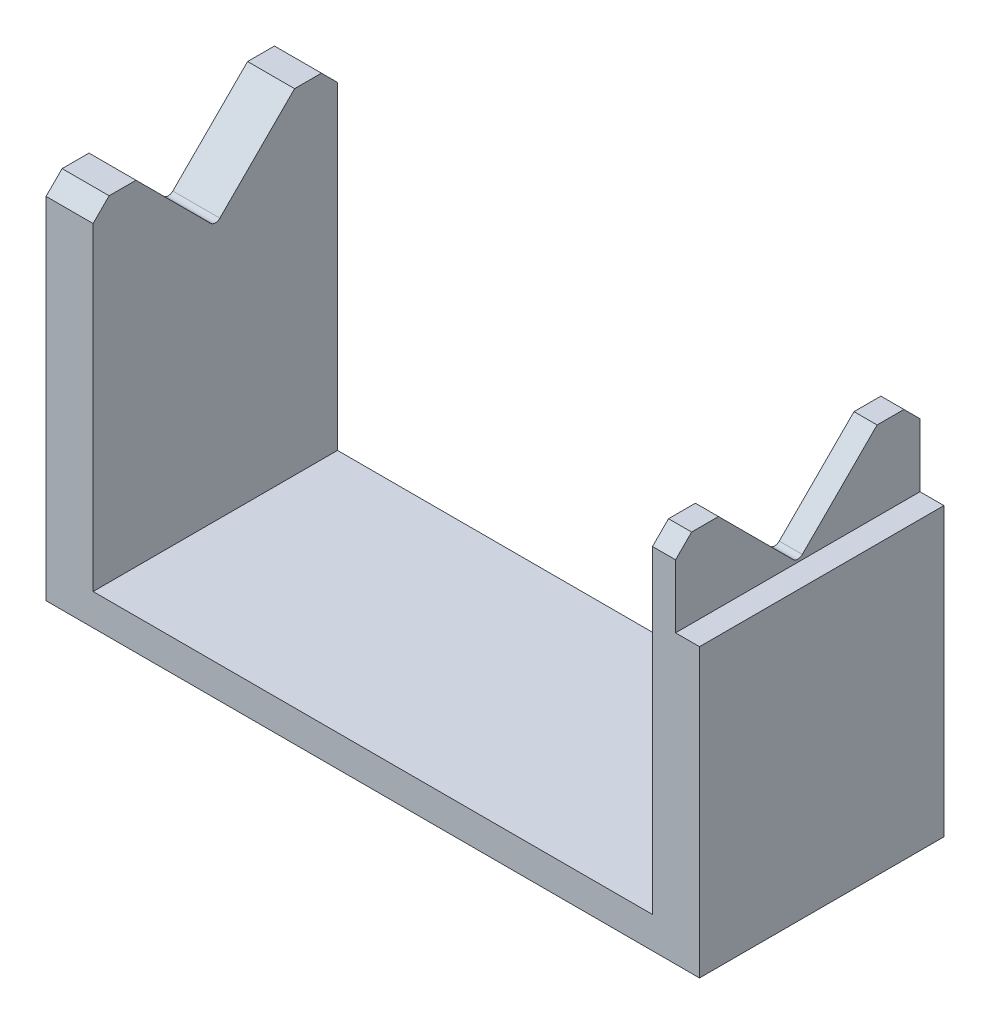
ISO-10303-21;
HEADER;
FILE_DESCRIPTION(('STEP AP214'),'2;1');
FILE_NAME('part.step','',(''),(''),'','','');
FILE_SCHEMA(('AUTOMOTIVE_DESIGN { 1 0 10303 214 1 1 1 1 }'));
ENDSEC;
DATA;
#1=APPLICATION_CONTEXT('core data for automotive mechanical design processes');
#2=APPLICATION_PROTOCOL_DEFINITION('international standard','automotive_design',2000,#1);
#3=PRODUCT_CONTEXT('',#1,'mechanical');
#4=PRODUCT('Part','Part','',(#3));
#5=PRODUCT_RELATED_PRODUCT_CATEGORY('part','',(#4));
#6=PRODUCT_DEFINITION_FORMATION('','',#4);
#7=PRODUCT_DEFINITION_CONTEXT('part definition',#1,'design');
#8=PRODUCT_DEFINITION('design','',#6,#7);
#9=PRODUCT_DEFINITION_SHAPE('','',#8);
#10=(LENGTH_UNIT() NAMED_UNIT(*) SI_UNIT(.MILLI.,.METRE.));
#11=(NAMED_UNIT(*) PLANE_ANGLE_UNIT() SI_UNIT($,.RADIAN.));
#12=(NAMED_UNIT(*) SI_UNIT($,.STERADIAN.) SOLID_ANGLE_UNIT());
#13=UNCERTAINTY_MEASURE_WITH_UNIT(LENGTH_MEASURE(1.E-05),#10,'distance_accuracy_value','');
#14=(GEOMETRIC_REPRESENTATION_CONTEXT(3) GLOBAL_UNCERTAINTY_ASSIGNED_CONTEXT((#13)) GLOBAL_UNIT_ASSIGNED_CONTEXT((#10,
#11,#12)) REPRESENTATION_CONTEXT('',''));
#15=CARTESIAN_POINT('',(0.,0.,0.));
#16=DIRECTION('',(0.,0.,1.));
#17=DIRECTION('',(1.,0.,0.));
#18=AXIS2_PLACEMENT_3D('',#15,#16,#17);
#19=CARTESIAN_POINT('',(0.,57.09,0.));
#20=DIRECTION('',(0.,1.,0.));
#21=DIRECTION('',(0.,0.,1.));
#22=AXIS2_PLACEMENT_3D('',#19,#20,#21);
#23=PLANE('',#22);
#24=DIRECTION('',(0.,0.,1.));
#25=VECTOR('',#24,1.);
#26=CARTESIAN_POINT('',(-43.6,57.09,0.));
#27=LINE('',#26,#25);
#28=CARTESIAN_POINT('',(-43.6,57.09,-16.55));
#29=VERTEX_POINT('',#28);
#30=CARTESIAN_POINT('',(-43.6,57.09,-12.36));
#31=VERTEX_POINT('',#30);
#32=EDGE_CURVE('E294',#29,#31,#27,.T.);
#33=ORIENTED_EDGE('',*,*,#32,.F.);
#34=DIRECTION('',(-1.,0.,0.));
#35=VECTOR('',#34,1.);
#36=CARTESIAN_POINT('',(-50.93,57.09,-16.55));
#37=LINE('',#36,#35);
#38=CARTESIAN_POINT('',(-50.93,57.09,-16.55));
#39=VERTEX_POINT('',#38);
#40=EDGE_CURVE('E332',#29,#39,#37,.T.);
#41=ORIENTED_EDGE('',*,*,#40,.T.);
#42=DIRECTION('',(0.,0.,1.));
#43=VECTOR('',#42,1.);
#44=CARTESIAN_POINT('',(-50.93,57.09,19.05));
#45=LINE('',#44,#43);
#46=CARTESIAN_POINT('',(-50.93,57.09,-12.36));
#47=VERTEX_POINT('',#46);
#48=EDGE_CURVE('E269',#39,#47,#45,.T.);
#49=ORIENTED_EDGE('',*,*,#48,.T.);
#50=DIRECTION('',(1.,0.,0.));
#51=VECTOR('',#50,1.);
#52=CARTESIAN_POINT('',(-952.8,57.09,-12.36));
#53=LINE('',#52,#51);
#54=EDGE_CURVE('E214',#47,#31,#53,.T.);
#55=ORIENTED_EDGE('',*,*,#54,.T.);
#56=EDGE_LOOP('',(#33,#41,#49,#55));
#57=FACE_BOUND('',#56,.T.);
#58=ADVANCED_FACE('F33',(#57),#23,.T.);
#59=DIRECTION('',(0.,0.,1.));
#60=VECTOR('',#59,1.);
#61=CARTESIAN_POINT('',(47.2,57.09,0.));
#62=LINE('',#61,#60);
#63=CARTESIAN_POINT('',(47.2,57.09,-16.55));
#64=VERTEX_POINT('',#63);
#65=CARTESIAN_POINT('',(47.2,57.09,-12.36));
#66=VERTEX_POINT('',#65);
#67=EDGE_CURVE('E186',#64,#66,#62,.T.);
#68=ORIENTED_EDGE('',*,*,#67,.F.);
#69=DIRECTION('',(-1.,0.,0.));
#70=VECTOR('',#69,1.);
#71=CARTESIAN_POINT('',(43.6,57.09,-16.55));
#72=LINE('',#71,#70);
#73=CARTESIAN_POINT('',(43.6,57.09,-16.55));
#74=VERTEX_POINT('',#73);
#75=EDGE_CURVE('E339',#64,#74,#72,.T.);
#76=ORIENTED_EDGE('',*,*,#75,.T.);
#77=DIRECTION('',(0.,0.,-1.));
#78=VECTOR('',#77,1.);
#79=CARTESIAN_POINT('',(43.6,57.09,0.));
#80=LINE('',#79,#78);
#81=CARTESIAN_POINT('',(43.6,57.09,-12.36));
#82=VERTEX_POINT('',#81);
#83=EDGE_CURVE('E213',#82,#74,#80,.T.);
#84=ORIENTED_EDGE('',*,*,#83,.F.);
#85=EDGE_CURVE('E205',#82,#66,#53,.T.);
#86=ORIENTED_EDGE('',*,*,#85,.T.);
#87=EDGE_LOOP('',(#68,#76,#84,#86));
#88=FACE_BOUND('',#87,.T.);
#89=ADVANCED_FACE('F211',(#88),#23,.T.);
#90=CARTESIAN_POINT('',(47.2,44.73,-38.04));
#91=DIRECTION('',(-1.,0.,0.));
#92=DIRECTION('',(0.,0.,1.));
#93=AXIS2_PLACEMENT_3D('',#90,#91,#92);
#94=PLANE('',#93);
#95=DIRECTION('',(0.,-1.,0.));
#96=VECTOR('',#95,1.);
#97=CARTESIAN_POINT('',(47.2,57.09,-19.05));
#98=LINE('',#97,#96);
#99=CARTESIAN_POINT('',(47.2,54.59,-19.05));
#100=VERTEX_POINT('',#99);
#101=CARTESIAN_POINT('',(47.2,44.73,-19.05));
#102=VERTEX_POINT('',#101);
#103=EDGE_CURVE('E246',#100,#102,#98,.T.);
#104=ORIENTED_EDGE('',*,*,#103,.F.);
#105=DIRECTION('',(0.,0.707106781186551,0.707106781186544));
#106=VECTOR('',#105,1.);
#107=CARTESIAN_POINT('',(47.2,57.09,-16.55));
#108=LINE('',#107,#106);
#109=EDGE_CURVE('E41',#100,#64,#108,.T.);
#110=ORIENTED_EDGE('',*,*,#109,.T.);
#111=ORIENTED_EDGE('',*,*,#67,.T.);
#112=DIRECTION('',(0.,0.707106781186549,-0.707106781186546));
#113=VECTOR('',#112,1.);
#114=CARTESIAN_POINT('',(47.2,44.73,0.));
#115=LINE('',#114,#113);
#116=CARTESIAN_POINT('',(47.2,45.4371067811865,-0.707106781186543));
#117=VERTEX_POINT('',#116);
#118=EDGE_CURVE('E191',#117,#66,#115,.T.);
#119=ORIENTED_EDGE('',*,*,#118,.F.);
#120=CARTESIAN_POINT('',(47.2,46.1442135623731,0.));
#121=DIRECTION('',(-1.,0.,0.));
#122=DIRECTION('',(0.,0.,1.));
#123=AXIS2_PLACEMENT_3D('',#120,#121,#122);
#124=CIRCLE('',#123,1.);
#125=CARTESIAN_POINT('',(47.2,45.4371067811865,0.707106781186546));
#126=VERTEX_POINT('',#125);
#127=EDGE_CURVE('E313',#117,#126,#124,.T.);
#128=ORIENTED_EDGE('',*,*,#127,.T.);
#129=DIRECTION('',(0.,-0.707106781186544,-0.707106781186551));
#130=VECTOR('',#129,1.);
#131=CARTESIAN_POINT('',(47.2,44.73,0.));
#132=LINE('',#131,#130);
#133=CARTESIAN_POINT('',(47.2,57.09,12.3600000000001));
#134=VERTEX_POINT('',#133);
#135=EDGE_CURVE('E209',#134,#126,#132,.T.);
#136=ORIENTED_EDGE('',*,*,#135,.F.);
#137=CARTESIAN_POINT('',(47.2,57.09,16.55));
#138=VERTEX_POINT('',#137);
#139=EDGE_CURVE('E198',#134,#138,#62,.T.);
#140=ORIENTED_EDGE('',*,*,#139,.T.);
#141=DIRECTION('',(0.,-0.707106781186552,0.707106781186543));
#142=VECTOR('',#141,1.);
#143=CARTESIAN_POINT('',(47.2,57.09,16.55));
#144=LINE('',#143,#142);
#145=CARTESIAN_POINT('',(47.2,54.59,19.05));
#146=VERTEX_POINT('',#145);
#147=EDGE_CURVE('E48',#138,#146,#144,.T.);
#148=ORIENTED_EDGE('',*,*,#147,.T.);
#149=DIRECTION('',(0.,-1.,0.));
#150=VECTOR('',#149,1.);
#151=CARTESIAN_POINT('',(47.2,44.73,19.05));
#152=LINE('',#151,#150);
#153=CARTESIAN_POINT('',(47.2,44.73,19.05));
#154=VERTEX_POINT('',#153);
#155=EDGE_CURVE('E238',#146,#154,#152,.T.);
#156=ORIENTED_EDGE('',*,*,#155,.T.);
#157=DIRECTION('',(0.,0.,1.));
#158=VECTOR('',#157,1.);
#159=CARTESIAN_POINT('',(47.2,44.73,-38.04));
#160=LINE('',#159,#158);
#161=CARTESIAN_POINT('',(47.2,44.73,0.));
#162=VERTEX_POINT('',#161);
#163=EDGE_CURVE('E242',#162,#154,#160,.T.);
#164=ORIENTED_EDGE('',*,*,#163,.F.);
#165=EDGE_CURVE('E247',#102,#162,#160,.T.);
#166=ORIENTED_EDGE('',*,*,#165,.F.);
#167=EDGE_LOOP('',(#104,#110,#111,#119,#128,#136,#140,#148,#156,#164,#166));
#168=FACE_BOUND('',#167,.T.);
#169=ADVANCED_FACE('F189',(#168),#94,.F.);
#170=CARTESIAN_POINT('',(-50.93,57.09,12.3600000000001));
#171=VERTEX_POINT('',#170);
#172=CARTESIAN_POINT('',(-50.93,57.09,16.55));
#173=VERTEX_POINT('',#172);
#174=EDGE_CURVE('E272',#171,#173,#45,.T.);
#175=ORIENTED_EDGE('',*,*,#174,.T.);
#176=DIRECTION('',(1.,0.,0.));
#177=VECTOR('',#176,1.);
#178=CARTESIAN_POINT('',(-43.6,57.09,16.55));
#179=LINE('',#178,#177);
#180=CARTESIAN_POINT('',(-43.6,57.09,16.55));
#181=VERTEX_POINT('',#180);
#182=EDGE_CURVE('E317',#173,#181,#179,.T.);
#183=ORIENTED_EDGE('',*,*,#182,.T.);
#184=CARTESIAN_POINT('',(-43.6,57.09,12.3600000000001));
#185=VERTEX_POINT('',#184);
#186=EDGE_CURVE('E293',#185,#181,#27,.T.);
#187=ORIENTED_EDGE('',*,*,#186,.F.);
#188=DIRECTION('',(1.,0.,0.));
#189=VECTOR('',#188,1.);
#190=CARTESIAN_POINT('',(-952.8,57.09,12.3600000000001));
#191=LINE('',#190,#189);
#192=EDGE_CURVE('E225',#171,#185,#191,.T.);
#193=ORIENTED_EDGE('',*,*,#192,.F.);
#194=EDGE_LOOP('',(#175,#183,#187,#193));
#195=FACE_BOUND('',#194,.T.);
#196=ADVANCED_FACE('F389',(#195),#23,.T.);
#197=CARTESIAN_POINT('',(-50.93,57.09,19.05));
#198=DIRECTION('',(1.,0.,0.));
#199=DIRECTION('',(0.,0.,-1.));
#200=AXIS2_PLACEMENT_3D('',#197,#198,#199);
#201=PLANE('',#200);
#202=DIRECTION('',(0.,-1.,0.));
#203=VECTOR('',#202,1.);
#204=CARTESIAN_POINT('',(-50.93,57.09,19.05));
#205=LINE('',#204,#203);
#206=CARTESIAN_POINT('',(-50.93,54.59,19.05));
#207=VERTEX_POINT('',#206);
#208=CARTESIAN_POINT('',(-50.93,0.,19.05));
#209=VERTEX_POINT('',#208);
#210=EDGE_CURVE('E289',#207,#209,#205,.T.);
#211=ORIENTED_EDGE('',*,*,#210,.F.);
#212=DIRECTION('',(0.,0.707106781186552,-0.707106781186543));
#213=VECTOR('',#212,1.);
#214=CARTESIAN_POINT('',(-50.93,57.09,16.55));
#215=LINE('',#214,#213);
#216=EDGE_CURVE('E330',#207,#173,#215,.T.);
#217=ORIENTED_EDGE('',*,*,#216,.T.);
#218=ORIENTED_EDGE('',*,*,#174,.F.);
#219=DIRECTION('',(0.,-0.707106781186544,-0.707106781186551));
#220=VECTOR('',#219,1.);
#221=CARTESIAN_POINT('',(-50.93,60.4349999999999,15.7050000000001));
#222=LINE('',#221,#220);
#223=CARTESIAN_POINT('',(-50.93,45.4371067811865,0.707106781186545));
#224=VERTEX_POINT('',#223);
#225=EDGE_CURVE('E227',#171,#224,#222,.T.);
#226=ORIENTED_EDGE('',*,*,#225,.T.);
#227=CARTESIAN_POINT('',(-50.93,46.1442135623731,0.));
#228=DIRECTION('',(1.,0.,0.));
#229=DIRECTION('',(0.,0.,-1.));
#230=AXIS2_PLACEMENT_3D('',#227,#228,#229);
#231=CIRCLE('',#230,1.);
#232=CARTESIAN_POINT('',(-50.93,45.4371067811865,-0.707106781186542));
#233=VERTEX_POINT('',#232);
#234=EDGE_CURVE('E311',#224,#233,#231,.T.);
#235=ORIENTED_EDGE('',*,*,#234,.T.);
#236=DIRECTION('',(0.,0.707106781186549,-0.707106781186546));
#237=VECTOR('',#236,1.);
#238=CARTESIAN_POINT('',(-50.93,41.385,3.34499999999997));
#239=LINE('',#238,#237);
#240=EDGE_CURVE('E235',#233,#47,#239,.T.);
#241=ORIENTED_EDGE('',*,*,#240,.T.);
#242=ORIENTED_EDGE('',*,*,#48,.F.);
#243=DIRECTION('',(0.,-0.707106781186551,-0.707106781186544));
#244=VECTOR('',#243,1.);
#245=CARTESIAN_POINT('',(-50.93,57.09,-16.55));
#246=LINE('',#245,#244);
#247=CARTESIAN_POINT('',(-50.93,54.59,-19.05));
#248=VERTEX_POINT('',#247);
#249=EDGE_CURVE('E328',#39,#248,#246,.T.);
#250=ORIENTED_EDGE('',*,*,#249,.T.);
#251=DIRECTION('',(0.,-1.,0.));
#252=VECTOR('',#251,1.);
#253=CARTESIAN_POINT('',(-50.93,57.09,-19.05));
#254=LINE('',#253,#252);
#255=CARTESIAN_POINT('',(-50.93,0.,-19.05));
#256=VERTEX_POINT('',#255);
#257=EDGE_CURVE('E271',#248,#256,#254,.T.);
#258=ORIENTED_EDGE('',*,*,#257,.T.);
#259=DIRECTION('',(0.,0.,1.));
#260=VECTOR('',#259,1.);
#261=CARTESIAN_POINT('',(-50.93,0.,19.05));
#262=LINE('',#261,#260);
#263=EDGE_CURVE('E268',#256,#209,#262,.T.);
#264=ORIENTED_EDGE('',*,*,#263,.T.);
#265=EDGE_LOOP('',(#211,#217,#218,#226,#235,#241,#242,#250,#258,#264));
#266=FACE_BOUND('',#265,.T.);
#267=ADVANCED_FACE('F404',(#266),#201,.F.);
#268=CARTESIAN_POINT('',(50.93,57.09,19.05));
#269=DIRECTION('',(0.,0.,-1.));
#270=DIRECTION('',(-1.,0.,0.));
#271=AXIS2_PLACEMENT_3D('',#268,#269,#270);
#272=PLANE('',#271);
#273=DIRECTION('',(0.,-1.,0.));
#274=VECTOR('',#273,1.);
#275=CARTESIAN_POINT('',(-43.6,57.09,19.05));
#276=LINE('',#275,#274);
#277=CARTESIAN_POINT('',(-43.6,54.59,19.05));
#278=VERTEX_POINT('',#277);
#279=CARTESIAN_POINT('',(-43.6,4.90999999999999,19.05));
#280=VERTEX_POINT('',#279);
#281=EDGE_CURVE('E256',#278,#280,#276,.T.);
#282=ORIENTED_EDGE('',*,*,#281,.F.);
#283=DIRECTION('',(-1.,0.,0.));
#284=VECTOR('',#283,1.);
#285=CARTESIAN_POINT('',(-50.93,54.59,19.05));
#286=LINE('',#285,#284);
#287=EDGE_CURVE('E326',#278,#207,#286,.T.);
#288=ORIENTED_EDGE('',*,*,#287,.T.);
#289=ORIENTED_EDGE('',*,*,#210,.T.);
#290=DIRECTION('',(1.,0.,0.));
#291=VECTOR('',#290,1.);
#292=CARTESIAN_POINT('',(50.93,0.,19.05));
#293=LINE('',#292,#291);
#294=CARTESIAN_POINT('',(50.93,0.,19.05));
#295=VERTEX_POINT('',#294);
#296=EDGE_CURVE('E275',#209,#295,#293,.T.);
#297=ORIENTED_EDGE('',*,*,#296,.T.);
#298=DIRECTION('',(0.,-1.,0.));
#299=VECTOR('',#298,1.);
#300=CARTESIAN_POINT('',(50.93,57.09,19.05));
#301=LINE('',#300,#299);
#302=CARTESIAN_POINT('',(50.93,44.73,19.05));
#303=VERTEX_POINT('',#302);
#304=EDGE_CURVE('E287',#303,#295,#301,.T.);
#305=ORIENTED_EDGE('',*,*,#304,.F.);
#306=DIRECTION('',(1.,0.,0.));
#307=VECTOR('',#306,1.);
#308=CARTESIAN_POINT('',(47.2,44.73,19.05));
#309=LINE('',#308,#307);
#310=EDGE_CURVE('E240',#154,#303,#309,.T.);
#311=ORIENTED_EDGE('',*,*,#310,.F.);
#312=ORIENTED_EDGE('',*,*,#155,.F.);
#313=DIRECTION('',(-1.,0.,0.));
#314=VECTOR('',#313,1.);
#315=CARTESIAN_POINT('',(43.6,54.59,19.05));
#316=LINE('',#315,#314);
#317=CARTESIAN_POINT('',(43.6,54.59,19.05));
#318=VERTEX_POINT('',#317);
#319=EDGE_CURVE('E324',#146,#318,#316,.T.);
#320=ORIENTED_EDGE('',*,*,#319,.T.);
#321=DIRECTION('',(0.,1.,0.));
#322=VECTOR('',#321,1.);
#323=CARTESIAN_POINT('',(43.6,57.09,19.05));
#324=LINE('',#323,#322);
#325=CARTESIAN_POINT('',(43.6,4.91,19.05));
#326=VERTEX_POINT('',#325);
#327=EDGE_CURVE('E254',#326,#318,#324,.T.);
#328=ORIENTED_EDGE('',*,*,#327,.F.);
#329=DIRECTION('',(1.,0.,0.));
#330=VECTOR('',#329,1.);
#331=CARTESIAN_POINT('',(-43.6,4.90999999999999,19.05));
#332=LINE('',#331,#330);
#333=EDGE_CURVE('E251',#280,#326,#332,.T.);
#334=ORIENTED_EDGE('',*,*,#333,.F.);
#335=EDGE_LOOP('',(#282,#288,#289,#297,#305,#311,#312,#320,#328,#334));
#336=FACE_BOUND('',#335,.T.);
#337=ADVANCED_FACE('F352',(#336),#272,.F.);
#338=CARTESIAN_POINT('',(50.93,57.09,19.05));
#339=DIRECTION('',(-1.,0.,0.));
#340=DIRECTION('',(0.,0.,1.));
#341=AXIS2_PLACEMENT_3D('',#338,#339,#340);
#342=PLANE('',#341);
#343=DIRECTION('',(0.,-1.,0.));
#344=VECTOR('',#343,1.);
#345=CARTESIAN_POINT('',(50.93,57.09,-19.05));
#346=LINE('',#345,#344);
#347=CARTESIAN_POINT('',(50.93,44.73,-19.05));
#348=VERTEX_POINT('',#347);
#349=CARTESIAN_POINT('',(50.93,0.,-19.05));
#350=VERTEX_POINT('',#349);
#351=EDGE_CURVE('E285',#348,#350,#346,.T.);
#352=ORIENTED_EDGE('',*,*,#351,.F.);
#353=DIRECTION('',(0.,0.,1.));
#354=VECTOR('',#353,1.);
#355=CARTESIAN_POINT('',(50.93,44.73,-38.04));
#356=LINE('',#355,#354);
#357=EDGE_CURVE('E243',#348,#303,#356,.T.);
#358=ORIENTED_EDGE('',*,*,#357,.T.);
#359=ORIENTED_EDGE('',*,*,#304,.T.);
#360=DIRECTION('',(0.,0.,-1.));
#361=VECTOR('',#360,1.);
#362=CARTESIAN_POINT('',(50.93,0.,19.05));
#363=LINE('',#362,#361);
#364=EDGE_CURVE('E278',#295,#350,#363,.T.);
#365=ORIENTED_EDGE('',*,*,#364,.T.);
#366=EDGE_LOOP('',(#352,#358,#359,#365));
#367=FACE_BOUND('',#366,.T.);
#368=ADVANCED_FACE('F401',(#367),#342,.F.);
#369=CARTESIAN_POINT('',(50.93,57.09,-19.05));
#370=DIRECTION('',(0.,0.,1.));
#371=DIRECTION('',(1.,0.,0.));
#372=AXIS2_PLACEMENT_3D('',#369,#370,#371);
#373=PLANE('',#372);
#374=ORIENTED_EDGE('',*,*,#257,.F.);
#375=DIRECTION('',(1.,0.,0.));
#376=VECTOR('',#375,1.);
#377=CARTESIAN_POINT('',(-43.6,54.59,-19.05));
#378=LINE('',#377,#376);
#379=CARTESIAN_POINT('',(-43.6,54.59,-19.05));
#380=VERTEX_POINT('',#379);
#381=EDGE_CURVE('E337',#248,#380,#378,.T.);
#382=ORIENTED_EDGE('',*,*,#381,.T.);
#383=DIRECTION('',(0.,-1.,0.));
#384=VECTOR('',#383,1.);
#385=CARTESIAN_POINT('',(-43.6,57.09,-19.05));
#386=LINE('',#385,#384);
#387=CARTESIAN_POINT('',(-43.6,4.90999999999999,-19.05));
#388=VERTEX_POINT('',#387);
#389=EDGE_CURVE('E266',#380,#388,#386,.T.);
#390=ORIENTED_EDGE('',*,*,#389,.T.);
#391=DIRECTION('',(1.,0.,0.));
#392=VECTOR('',#391,1.);
#393=CARTESIAN_POINT('',(50.93,4.91,-19.05));
#394=LINE('',#393,#392);
#395=CARTESIAN_POINT('',(43.6,4.91,-19.05));
#396=VERTEX_POINT('',#395);
#397=EDGE_CURVE('E296',#388,#396,#394,.T.);
#398=ORIENTED_EDGE('',*,*,#397,.T.);
#399=DIRECTION('',(0.,1.,0.));
#400=VECTOR('',#399,1.);
#401=CARTESIAN_POINT('',(43.6,57.09,-19.05));
#402=LINE('',#401,#400);
#403=CARTESIAN_POINT('',(43.6,54.59,-19.05));
#404=VERTEX_POINT('',#403);
#405=EDGE_CURVE('E262',#396,#404,#402,.T.);
#406=ORIENTED_EDGE('',*,*,#405,.T.);
#407=DIRECTION('',(1.,0.,0.));
#408=VECTOR('',#407,1.);
#409=CARTESIAN_POINT('',(47.2,54.59,-19.05));
#410=LINE('',#409,#408);
#411=EDGE_CURVE('E335',#404,#100,#410,.T.);
#412=ORIENTED_EDGE('',*,*,#411,.T.);
#413=ORIENTED_EDGE('',*,*,#103,.T.);
#414=DIRECTION('',(1.,0.,0.));
#415=VECTOR('',#414,1.);
#416=CARTESIAN_POINT('',(50.93,44.73,-19.05));
#417=LINE('',#416,#415);
#418=EDGE_CURVE('E197',#102,#348,#417,.T.);
#419=ORIENTED_EDGE('',*,*,#418,.T.);
#420=ORIENTED_EDGE('',*,*,#351,.T.);
#421=DIRECTION('',(-1.,0.,0.));
#422=VECTOR('',#421,1.);
#423=CARTESIAN_POINT('',(50.93,0.,-19.05));
#424=LINE('',#423,#422);
#425=EDGE_CURVE('E281',#350,#256,#424,.T.);
#426=ORIENTED_EDGE('',*,*,#425,.T.);
#427=EDGE_LOOP('',(#374,#382,#390,#398,#406,#412,#413,#419,#420,#426));
#428=FACE_BOUND('',#427,.T.);
#429=ADVANCED_FACE('F371',(#428),#373,.F.);
#430=CARTESIAN_POINT('',(43.6,57.09,16.55));
#431=VERTEX_POINT('',#430);
#432=CARTESIAN_POINT('',(43.6,57.09,12.3600000000001));
#433=VERTEX_POINT('',#432);
#434=EDGE_CURVE('E291',#431,#433,#80,.T.);
#435=ORIENTED_EDGE('',*,*,#434,.F.);
#436=DIRECTION('',(1.,0.,0.));
#437=VECTOR('',#436,1.);
#438=CARTESIAN_POINT('',(47.2,57.09,16.55));
#439=LINE('',#438,#437);
#440=EDGE_CURVE('E11',#431,#138,#439,.T.);
#441=ORIENTED_EDGE('',*,*,#440,.T.);
#442=ORIENTED_EDGE('',*,*,#139,.F.);
#443=EDGE_CURVE('E217',#433,#134,#191,.T.);
#444=ORIENTED_EDGE('',*,*,#443,.F.);
#445=EDGE_LOOP('',(#435,#441,#442,#444));
#446=FACE_BOUND('',#445,.T.);
#447=ADVANCED_FACE('F356',(#446),#23,.T.);
#448=CARTESIAN_POINT('',(0.,0.,0.));
#449=DIRECTION('',(0.,1.,0.));
#450=DIRECTION('',(0.,0.,1.));
#451=AXIS2_PLACEMENT_3D('',#448,#449,#450);
#452=PLANE('',#451);
#453=ORIENTED_EDGE('',*,*,#263,.F.);
#454=ORIENTED_EDGE('',*,*,#425,.F.);
#455=ORIENTED_EDGE('',*,*,#364,.F.);
#456=ORIENTED_EDGE('',*,*,#296,.F.);
#457=EDGE_LOOP('',(#453,#454,#455,#456));
#458=FACE_BOUND('',#457,.T.);
#459=ADVANCED_FACE('F394',(#458),#452,.F.);
#460=CARTESIAN_POINT('',(-43.6,4.90999999999999,-38.04));
#461=DIRECTION('',(0.,-1.,0.));
#462=DIRECTION('',(1.,0.,0.));
#463=AXIS2_PLACEMENT_3D('',#460,#461,#462);
#464=PLANE('',#463);
#465=DIRECTION('',(0.,0.,1.));
#466=VECTOR('',#465,1.);
#467=CARTESIAN_POINT('',(-43.6,4.90999999999999,-38.04));
#468=LINE('',#467,#466);
#469=EDGE_CURVE('E259',#388,#280,#468,.T.);
#470=ORIENTED_EDGE('',*,*,#469,.T.);
#471=ORIENTED_EDGE('',*,*,#333,.T.);
#472=DIRECTION('',(0.,0.,1.));
#473=VECTOR('',#472,1.);
#474=CARTESIAN_POINT('',(43.6,4.91,-38.04));
#475=LINE('',#474,#473);
#476=EDGE_CURVE('E258',#396,#326,#475,.T.);
#477=ORIENTED_EDGE('',*,*,#476,.F.);
#478=ORIENTED_EDGE('',*,*,#397,.F.);
#479=EDGE_LOOP('',(#470,#471,#477,#478));
#480=FACE_BOUND('',#479,.T.);
#481=ADVANCED_FACE('F399',(#480),#464,.F.);
#482=CARTESIAN_POINT('',(-43.6,57.09,-38.04));
#483=DIRECTION('',(-1.,0.,0.));
#484=DIRECTION('',(0.,0.,1.));
#485=AXIS2_PLACEMENT_3D('',#482,#483,#484);
#486=PLANE('',#485);
#487=ORIENTED_EDGE('',*,*,#186,.T.);
#488=DIRECTION('',(0.,-0.707106781186552,0.707106781186543));
#489=VECTOR('',#488,1.);
#490=CARTESIAN_POINT('',(-43.6,57.09,16.55));
#491=LINE('',#490,#489);
#492=EDGE_CURVE('E322',#181,#278,#491,.T.);
#493=ORIENTED_EDGE('',*,*,#492,.T.);
#494=ORIENTED_EDGE('',*,*,#281,.T.);
#495=ORIENTED_EDGE('',*,*,#469,.F.);
#496=ORIENTED_EDGE('',*,*,#389,.F.);
#497=DIRECTION('',(0.,0.707106781186551,0.707106781186544));
#498=VECTOR('',#497,1.);
#499=CARTESIAN_POINT('',(-43.6,57.09,-16.55));
#500=LINE('',#499,#498);
#501=EDGE_CURVE('E320',#380,#29,#500,.T.);
#502=ORIENTED_EDGE('',*,*,#501,.T.);
#503=ORIENTED_EDGE('',*,*,#32,.T.);
#504=DIRECTION('',(0.,-0.707106781186549,0.707106781186546));
#505=VECTOR('',#504,1.);
#506=CARTESIAN_POINT('',(-43.6,69.93,-25.1999999999999));
#507=LINE('',#506,#505);
#508=CARTESIAN_POINT('',(-43.6,45.4371067811865,-0.707106781186542));
#509=VERTEX_POINT('',#508);
#510=EDGE_CURVE('E232',#31,#509,#507,.T.);
#511=ORIENTED_EDGE('',*,*,#510,.T.);
#512=CARTESIAN_POINT('',(-43.6,46.1442135623731,0.));
#513=DIRECTION('',(-1.,0.,0.));
#514=DIRECTION('',(0.,0.,1.));
#515=AXIS2_PLACEMENT_3D('',#512,#513,#514);
#516=CIRCLE('',#515,1.);
#517=CARTESIAN_POINT('',(-43.6,45.4371067811865,0.707106781186542));
#518=VERTEX_POINT('',#517);
#519=EDGE_CURVE('E309',#509,#518,#516,.T.);
#520=ORIENTED_EDGE('',*,*,#519,.T.);
#521=DIRECTION('',(0.,0.707106781186544,0.707106781186551));
#522=VECTOR('',#521,1.);
#523=CARTESIAN_POINT('',(-43.6,31.8899999999999,-12.8400000000002));
#524=LINE('',#523,#522);
#525=EDGE_CURVE('E224',#518,#185,#524,.T.);
#526=ORIENTED_EDGE('',*,*,#525,.T.);
#527=EDGE_LOOP('',(#487,#493,#494,#495,#496,#502,#503,#511,#520,#526));
#528=FACE_BOUND('',#527,.T.);
#529=ADVANCED_FACE('F424',(#528),#486,.F.);
#530=CARTESIAN_POINT('',(43.6,57.09,-38.04));
#531=DIRECTION('',(1.,0.,0.));
#532=DIRECTION('',(0.,0.,-1.));
#533=AXIS2_PLACEMENT_3D('',#530,#531,#532);
#534=PLANE('',#533);
#535=ORIENTED_EDGE('',*,*,#83,.T.);
#536=DIRECTION('',(0.,-0.707106781186551,-0.707106781186544));
#537=VECTOR('',#536,1.);
#538=CARTESIAN_POINT('',(43.6,57.09,-16.55));
#539=LINE('',#538,#537);
#540=EDGE_CURVE('E342',#74,#404,#539,.T.);
#541=ORIENTED_EDGE('',*,*,#540,.T.);
#542=ORIENTED_EDGE('',*,*,#405,.F.);
#543=ORIENTED_EDGE('',*,*,#476,.T.);
#544=ORIENTED_EDGE('',*,*,#327,.T.);
#545=DIRECTION('',(0.,0.707106781186552,-0.707106781186543));
#546=VECTOR('',#545,1.);
#547=CARTESIAN_POINT('',(43.6,57.09,16.55));
#548=LINE('',#547,#546);
#549=EDGE_CURVE('E55',#318,#431,#548,.T.);
#550=ORIENTED_EDGE('',*,*,#549,.T.);
#551=ORIENTED_EDGE('',*,*,#434,.T.);
#552=DIRECTION('',(0.,-0.707106781186544,-0.707106781186551));
#553=VECTOR('',#552,1.);
#554=CARTESIAN_POINT('',(43.6,31.8899999999999,-12.8400000000002));
#555=LINE('',#554,#553);
#556=CARTESIAN_POINT('',(43.6,45.4371067811865,0.707106781186542));
#557=VERTEX_POINT('',#556);
#558=EDGE_CURVE('E221',#433,#557,#555,.T.);
#559=ORIENTED_EDGE('',*,*,#558,.T.);
#560=CARTESIAN_POINT('',(43.6,46.1442135623731,0.));
#561=DIRECTION('',(1.,0.,0.));
#562=DIRECTION('',(0.,0.,-1.));
#563=AXIS2_PLACEMENT_3D('',#560,#561,#562);
#564=CIRCLE('',#563,1.);
#565=CARTESIAN_POINT('',(43.6,45.4371067811865,-0.707106781186542));
#566=VERTEX_POINT('',#565);
#567=EDGE_CURVE('E315',#557,#566,#564,.T.);
#568=ORIENTED_EDGE('',*,*,#567,.T.);
#569=DIRECTION('',(0.,0.707106781186549,-0.707106781186546));
#570=VECTOR('',#569,1.);
#571=CARTESIAN_POINT('',(43.6,69.93,-25.1999999999999));
#572=LINE('',#571,#570);
#573=EDGE_CURVE('E230',#566,#82,#572,.T.);
#574=ORIENTED_EDGE('',*,*,#573,.T.);
#575=EDGE_LOOP('',(#535,#541,#542,#543,#544,#550,#551,#559,#568,#574));
#576=FACE_BOUND('',#575,.T.);
#577=ADVANCED_FACE('F359',(#576),#534,.F.);
#578=CARTESIAN_POINT('',(47.2,44.73,-38.04));
#579=DIRECTION('',(0.,-1.,0.));
#580=DIRECTION('',(0.,0.,-1.));
#581=AXIS2_PLACEMENT_3D('',#578,#579,#580);
#582=PLANE('',#581);
#583=ORIENTED_EDGE('',*,*,#165,.T.);
#584=ORIENTED_EDGE('',*,*,#163,.T.);
#585=ORIENTED_EDGE('',*,*,#310,.T.);
#586=ORIENTED_EDGE('',*,*,#357,.F.);
#587=ORIENTED_EDGE('',*,*,#418,.F.);
#588=EDGE_LOOP('',(#583,#584,#585,#586,#587));
#589=FACE_BOUND('',#588,.T.);
#590=ADVANCED_FACE('F515',(#589),#582,.F.);
#591=CARTESIAN_POINT('',(-952.8,44.73,0.));
#592=DIRECTION('',(0.,-0.707106781186551,0.707106781186544));
#593=DIRECTION('',(0.,-0.707106781186544,-0.707106781186551));
#594=AXIS2_PLACEMENT_3D('',#591,#592,#593);
#595=PLANE('',#594);
#596=ORIENTED_EDGE('',*,*,#135,.T.);
#597=DIRECTION('',(1.,0.,0.));
#598=VECTOR('',#597,1.);
#599=CARTESIAN_POINT('',(43.6,45.4371067811865,0.707106781186546));
#600=LINE('',#599,#598);
#601=EDGE_CURVE('E307',#126,#557,#600,.F.);
#602=ORIENTED_EDGE('',*,*,#601,.T.);
#603=ORIENTED_EDGE('',*,*,#558,.F.);
#604=ORIENTED_EDGE('',*,*,#443,.T.);
#605=EDGE_LOOP('',(#596,#602,#603,#604));
#606=FACE_BOUND('',#605,.T.);
#607=ADVANCED_FACE('F362',(#606),#595,.F.);
#608=CARTESIAN_POINT('',(-952.8,44.73,0.));
#609=DIRECTION('',(0.,-0.707106781186546,-0.707106781186549));
#610=DIRECTION('',(0.,0.707106781186549,-0.707106781186546));
#611=AXIS2_PLACEMENT_3D('',#608,#609,#610);
#612=PLANE('',#611);
#613=ORIENTED_EDGE('',*,*,#573,.F.);
#614=DIRECTION('',(1.,0.,0.));
#615=VECTOR('',#614,1.);
#616=CARTESIAN_POINT('',(47.2,45.4371067811865,-0.707106781186543));
#617=LINE('',#616,#615);
#618=EDGE_CURVE('E208',#566,#117,#617,.T.);
#619=ORIENTED_EDGE('',*,*,#618,.T.);
#620=ORIENTED_EDGE('',*,*,#118,.T.);
#621=ORIENTED_EDGE('',*,*,#85,.F.);
#622=EDGE_LOOP('',(#613,#619,#620,#621));
#623=FACE_BOUND('',#622,.T.);
#624=ADVANCED_FACE('F204',(#623),#612,.F.);
#625=ORIENTED_EDGE('',*,*,#240,.F.);
#626=DIRECTION('',(1.,0.,0.));
#627=VECTOR('',#626,1.);
#628=CARTESIAN_POINT('',(-43.6,45.4371067811865,-0.707106781186543));
#629=LINE('',#628,#627);
#630=EDGE_CURVE('E301',#233,#509,#629,.T.);
#631=ORIENTED_EDGE('',*,*,#630,.T.);
#632=ORIENTED_EDGE('',*,*,#510,.F.);
#633=ORIENTED_EDGE('',*,*,#54,.F.);
#634=EDGE_LOOP('',(#625,#631,#632,#633));
#635=FACE_BOUND('',#634,.T.);
#636=ADVANCED_FACE('F440',(#635),#612,.F.);
#637=ORIENTED_EDGE('',*,*,#525,.F.);
#638=DIRECTION('',(1.,0.,0.));
#639=VECTOR('',#638,1.);
#640=CARTESIAN_POINT('',(-50.93,45.4371067811865,0.707106781186546));
#641=LINE('',#640,#639);
#642=EDGE_CURVE('E304',#518,#224,#641,.F.);
#643=ORIENTED_EDGE('',*,*,#642,.T.);
#644=ORIENTED_EDGE('',*,*,#225,.F.);
#645=ORIENTED_EDGE('',*,*,#192,.T.);
#646=EDGE_LOOP('',(#637,#643,#644,#645));
#647=FACE_BOUND('',#646,.T.);
#648=ADVANCED_FACE('F445',(#647),#595,.F.);
#649=CARTESIAN_POINT('',(-952.8,46.1442135623731,0.));
#650=DIRECTION('',(-1.,0.,0.));
#651=DIRECTION('',(0.,0.,1.));
#652=AXIS2_PLACEMENT_3D('',#649,#650,#651);
#653=CYLINDRICAL_SURFACE('',#652,1.);
#654=ORIENTED_EDGE('',*,*,#234,.F.);
#655=ORIENTED_EDGE('',*,*,#642,.F.);
#656=ORIENTED_EDGE('',*,*,#519,.F.);
#657=ORIENTED_EDGE('',*,*,#630,.F.);
#658=EDGE_LOOP('',(#654,#655,#656,#657));
#659=FACE_BOUND('',#658,.T.);
#660=ADVANCED_FACE('F446',(#659),#653,.F.);
#661=CARTESIAN_POINT('',(-952.8,46.1442135623731,0.));
#662=DIRECTION('',(-1.,0.,0.));
#663=DIRECTION('',(0.,0.,1.));
#664=AXIS2_PLACEMENT_3D('',#661,#662,#663);
#665=CYLINDRICAL_SURFACE('',#664,1.);
#666=ORIENTED_EDGE('',*,*,#567,.F.);
#667=ORIENTED_EDGE('',*,*,#601,.F.);
#668=ORIENTED_EDGE('',*,*,#127,.F.);
#669=ORIENTED_EDGE('',*,*,#618,.F.);
#670=EDGE_LOOP('',(#666,#667,#668,#669));
#671=FACE_BOUND('',#670,.T.);
#672=ADVANCED_FACE('F365',(#671),#665,.F.);
#673=CARTESIAN_POINT('',(0.,57.09,16.55));
#674=DIRECTION('',(0.,0.707106781186543,0.707106781186552));
#675=DIRECTION('',(-1.,0.,0.));
#676=AXIS2_PLACEMENT_3D('',#673,#674,#675);
#677=PLANE('',#676);
#678=ORIENTED_EDGE('',*,*,#216,.F.);
#679=ORIENTED_EDGE('',*,*,#287,.F.);
#680=ORIENTED_EDGE('',*,*,#492,.F.);
#681=ORIENTED_EDGE('',*,*,#182,.F.);
#682=EDGE_LOOP('',(#678,#679,#680,#681));
#683=FACE_BOUND('',#682,.T.);
#684=ADVANCED_FACE('F380',(#683),#677,.T.);
#685=CARTESIAN_POINT('',(0.,57.09,-16.55));
#686=DIRECTION('',(0.,0.707106781186544,-0.707106781186551));
#687=DIRECTION('',(1.,0.,0.));
#688=AXIS2_PLACEMENT_3D('',#685,#686,#687);
#689=PLANE('',#688);
#690=ORIENTED_EDGE('',*,*,#501,.F.);
#691=ORIENTED_EDGE('',*,*,#381,.F.);
#692=ORIENTED_EDGE('',*,*,#249,.F.);
#693=ORIENTED_EDGE('',*,*,#40,.F.);
#694=EDGE_LOOP('',(#690,#691,#692,#693));
#695=FACE_BOUND('',#694,.T.);
#696=ADVANCED_FACE('F375',(#695),#689,.T.);
#697=CARTESIAN_POINT('',(0.,57.09,-16.55));
#698=DIRECTION('',(0.,0.707106781186544,-0.707106781186551));
#699=DIRECTION('',(1.,0.,0.));
#700=AXIS2_PLACEMENT_3D('',#697,#698,#699);
#701=PLANE('',#700);
#702=ORIENTED_EDGE('',*,*,#109,.F.);
#703=ORIENTED_EDGE('',*,*,#411,.F.);
#704=ORIENTED_EDGE('',*,*,#540,.F.);
#705=ORIENTED_EDGE('',*,*,#75,.F.);
#706=EDGE_LOOP('',(#702,#703,#704,#705));
#707=FACE_BOUND('',#706,.T.);
#708=ADVANCED_FACE('F373',(#707),#701,.T.);
#709=CARTESIAN_POINT('',(0.,57.09,16.55));
#710=DIRECTION('',(0.,0.707106781186543,0.707106781186552));
#711=DIRECTION('',(-1.,0.,0.));
#712=AXIS2_PLACEMENT_3D('',#709,#710,#711);
#713=PLANE('',#712);
#714=ORIENTED_EDGE('',*,*,#549,.F.);
#715=ORIENTED_EDGE('',*,*,#319,.F.);
#716=ORIENTED_EDGE('',*,*,#147,.F.);
#717=ORIENTED_EDGE('',*,*,#440,.F.);
#718=EDGE_LOOP('',(#714,#715,#716,#717));
#719=FACE_BOUND('',#718,.T.);
#720=ADVANCED_FACE('F35',(#719),#713,.T.);
#721=CLOSED_SHELL('',(#58,#89,#169,#196,#267,#337,#368,#429,#447,#459,#481,#529,#577,#590,#607,
#624,#636,#648,#660,#672,#684,#696,#708,#720));
#722=MANIFOLD_SOLID_BREP('B2',#721);
#723=ADVANCED_BREP_SHAPE_REPRESENTATION('',(#18,#722),#14);
#724=SHAPE_DEFINITION_REPRESENTATION(#9,#723);
ENDSEC;
END-ISO-10303-21;
